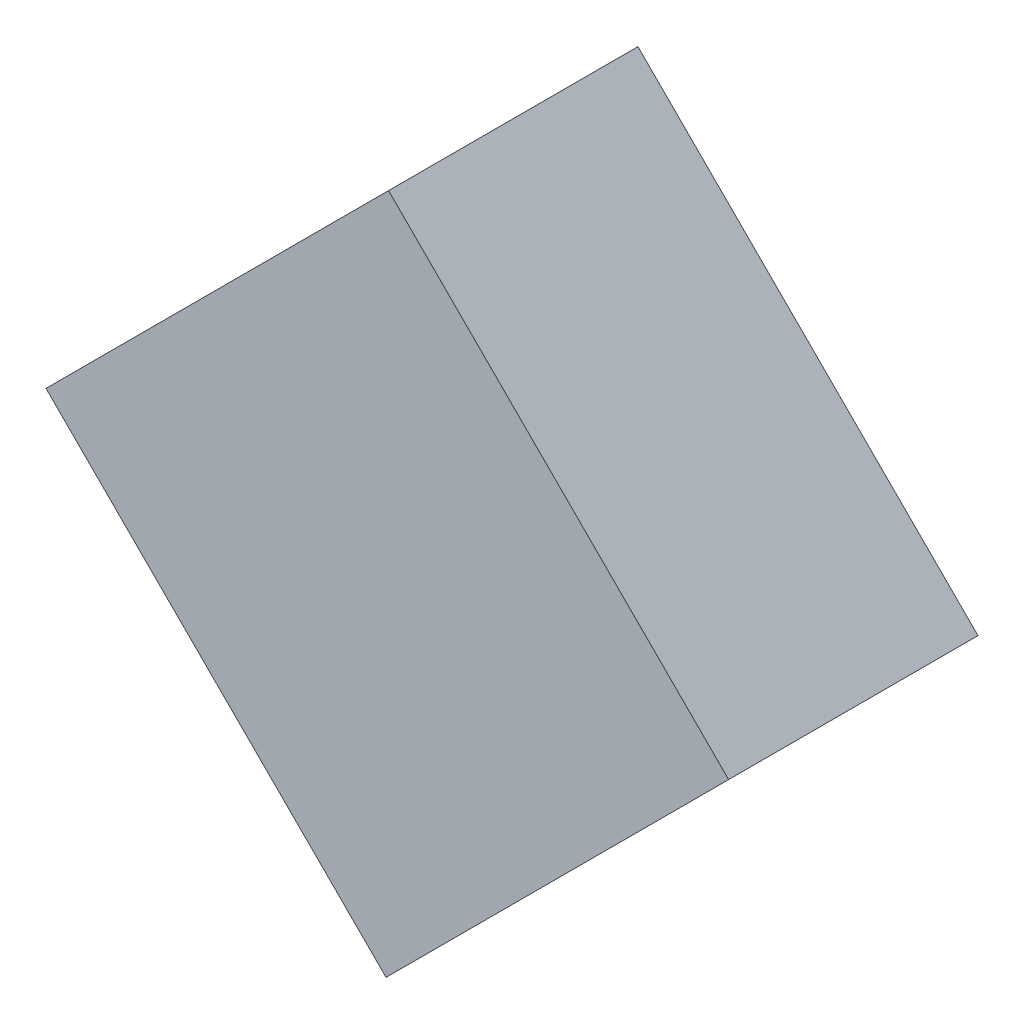
ISO-10303-21;
HEADER;
FILE_DESCRIPTION(('STEP AP214'),'2;1');
FILE_NAME('part.step','',(''),(''),'','','');
FILE_SCHEMA(('AUTOMOTIVE_DESIGN { 1 0 10303 214 1 1 1 1 }'));
ENDSEC;
DATA;
#1=APPLICATION_CONTEXT('core data for automotive mechanical design processes');
#2=APPLICATION_PROTOCOL_DEFINITION('international standard','automotive_design',2000,#1);
#3=PRODUCT_CONTEXT('',#1,'mechanical');
#4=PRODUCT('Part','Part','',(#3));
#5=PRODUCT_RELATED_PRODUCT_CATEGORY('part','',(#4));
#6=PRODUCT_DEFINITION_FORMATION('','',#4);
#7=PRODUCT_DEFINITION_CONTEXT('part definition',#1,'design');
#8=PRODUCT_DEFINITION('design','',#6,#7);
#9=PRODUCT_DEFINITION_SHAPE('','',#8);
#10=(LENGTH_UNIT() NAMED_UNIT(*) SI_UNIT(.MILLI.,.METRE.));
#11=(NAMED_UNIT(*) PLANE_ANGLE_UNIT() SI_UNIT($,.RADIAN.));
#12=(NAMED_UNIT(*) SI_UNIT($,.STERADIAN.) SOLID_ANGLE_UNIT());
#13=UNCERTAINTY_MEASURE_WITH_UNIT(LENGTH_MEASURE(1.E-05),#10,'distance_accuracy_value','');
#14=(GEOMETRIC_REPRESENTATION_CONTEXT(3) GLOBAL_UNCERTAINTY_ASSIGNED_CONTEXT((#13)) GLOBAL_UNIT_ASSIGNED_CONTEXT((#10,
#11,#12)) REPRESENTATION_CONTEXT('',''));
#15=CARTESIAN_POINT('',(0.,0.,0.));
#16=DIRECTION('',(0.,0.,1.));
#17=DIRECTION('',(1.,0.,0.));
#18=AXIS2_PLACEMENT_3D('',#15,#16,#17);
#19=CARTESIAN_POINT('',(0.003538219999996,0.95813118,0.));
#20=DIRECTION('',(0.707106781186548,0.707106781186548,0.));
#21=DIRECTION('',(0.707106781186548,-0.707106781186548,0.));
#22=AXIS2_PLACEMENT_3D('',#19,#20,#21);
#23=PLANE('',#22);
#24=DIRECTION('',(0.,0.,1.));
#25=VECTOR('',#24,1.);
#26=CARTESIAN_POINT('',(0.003538219999996,0.95813118,0.));
#27=LINE('',#26,#25);
#28=CARTESIAN_POINT('',(0.003538219999996,0.95813118,0.));
#29=VERTEX_POINT('',#28);
#30=CARTESIAN_POINT('',(0.003538219999996,0.95813118,0.70000114));
#31=VERTEX_POINT('',#30);
#32=EDGE_CURVE('E11',#29,#31,#27,.T.);
#33=ORIENTED_EDGE('',*,*,#32,.T.);
#34=DIRECTION('',(0.707106781186548,-0.707106781186548,0.));
#35=VECTOR('',#34,1.);
#36=CARTESIAN_POINT('',(0.003538219999996,0.95813118,0.70000114));
#37=LINE('',#36,#35);
#38=CARTESIAN_POINT('',(0.95813118,0.003538219999996,0.70000114));
#39=VERTEX_POINT('',#38);
#40=EDGE_CURVE('E23',#31,#39,#37,.T.);
#41=ORIENTED_EDGE('',*,*,#40,.T.);
#42=DIRECTION('',(0.,0.,1.));
#43=VECTOR('',#42,1.);
#44=CARTESIAN_POINT('',(0.95813118,0.003538219999996,0.));
#45=LINE('',#44,#43);
#46=CARTESIAN_POINT('',(0.95813118,0.003538219999996,0.));
#47=VERTEX_POINT('',#46);
#48=EDGE_CURVE('E84',#47,#39,#45,.T.);
#49=ORIENTED_EDGE('',*,*,#48,.F.);
#50=DIRECTION('',(0.707106781186548,-0.707106781186548,0.));
#51=VECTOR('',#50,1.);
#52=CARTESIAN_POINT('',(0.003538219999996,0.95813118,0.));
#53=LINE('',#52,#51);
#54=EDGE_CURVE('E82',#29,#47,#53,.T.);
#55=ORIENTED_EDGE('',*,*,#54,.F.);
#56=EDGE_LOOP('',(#33,#41,#49,#55));
#57=FACE_BOUND('',#56,.T.);
#58=ADVANCED_FACE('F16',(#57),#23,.T.);
#59=CARTESIAN_POINT('',(0.95813118,0.003538219999996,0.));
#60=DIRECTION('',(0.707106781186548,-0.707106781186548,0.));
#61=DIRECTION('',(-0.707106781186548,-0.707106781186548,0.));
#62=AXIS2_PLACEMENT_3D('',#59,#60,#61);
#63=PLANE('',#62);
#64=ORIENTED_EDGE('',*,*,#48,.T.);
#65=DIRECTION('',(-0.707106781186548,-0.707106781186548,0.));
#66=VECTOR('',#65,1.);
#67=CARTESIAN_POINT('',(0.95813118,0.003538219999996,0.70000114));
#68=LINE('',#67,#66);
#69=CARTESIAN_POINT('',(-0.003535679999999,-0.95812864,0.70000114));
#70=VERTEX_POINT('',#69);
#71=EDGE_CURVE('E80',#39,#70,#68,.T.);
#72=ORIENTED_EDGE('',*,*,#71,.T.);
#73=DIRECTION('',(0.,0.,1.));
#74=VECTOR('',#73,1.);
#75=CARTESIAN_POINT('',(-0.003535679999999,-0.95812864,0.));
#76=LINE('',#75,#74);
#77=CARTESIAN_POINT('',(-0.003535679999999,-0.95812864,0.));
#78=VERTEX_POINT('',#77);
#79=EDGE_CURVE('E78',#78,#70,#76,.T.);
#80=ORIENTED_EDGE('',*,*,#79,.F.);
#81=DIRECTION('',(-0.707106781186548,-0.707106781186548,0.));
#82=VECTOR('',#81,1.);
#83=CARTESIAN_POINT('',(0.95813118,0.003538219999996,0.));
#84=LINE('',#83,#82);
#85=EDGE_CURVE('E69',#47,#78,#84,.T.);
#86=ORIENTED_EDGE('',*,*,#85,.F.);
#87=EDGE_LOOP('',(#64,#72,#80,#86));
#88=FACE_BOUND('',#87,.T.);
#89=ADVANCED_FACE('F89',(#88),#63,.T.);
#90=CARTESIAN_POINT('',(-0.003535679999999,-0.95812864,0.));
#91=DIRECTION('',(-0.707106781186548,-0.707106781186548,0.));
#92=DIRECTION('',(-0.707106781186548,0.707106781186548,0.));
#93=AXIS2_PLACEMENT_3D('',#90,#91,#92);
#94=PLANE('',#93);
#95=ORIENTED_EDGE('',*,*,#79,.T.);
#96=DIRECTION('',(-0.707106781186548,0.707106781186548,0.));
#97=VECTOR('',#96,1.);
#98=CARTESIAN_POINT('',(-0.003535679999999,-0.95812864,0.70000114));
#99=LINE('',#98,#97);
#100=CARTESIAN_POINT('',(-0.95812864,-0.003535680000013,0.70000114));
#101=VERTEX_POINT('',#100);
#102=EDGE_CURVE('E59',#70,#101,#99,.T.);
#103=ORIENTED_EDGE('',*,*,#102,.T.);
#104=DIRECTION('',(0.,0.,1.));
#105=VECTOR('',#104,1.);
#106=CARTESIAN_POINT('',(-0.95812864,-0.003535680000013,0.));
#107=LINE('',#106,#105);
#108=CARTESIAN_POINT('',(-0.95812864,-0.003535680000013,0.));
#109=VERTEX_POINT('',#108);
#110=EDGE_CURVE('E53',#109,#101,#107,.T.);
#111=ORIENTED_EDGE('',*,*,#110,.F.);
#112=DIRECTION('',(-0.707106781186548,0.707106781186548,0.));
#113=VECTOR('',#112,1.);
#114=CARTESIAN_POINT('',(-0.003535679999999,-0.95812864,0.));
#115=LINE('',#114,#113);
#116=EDGE_CURVE('E57',#78,#109,#115,.T.);
#117=ORIENTED_EDGE('',*,*,#116,.F.);
#118=EDGE_LOOP('',(#95,#103,#111,#117));
#119=FACE_BOUND('',#118,.T.);
#120=ADVANCED_FACE('F56',(#119),#94,.T.);
#121=CARTESIAN_POINT('',(-0.95812864,-0.003535680000013,0.));
#122=DIRECTION('',(-0.707106781186548,0.707106781186548,0.));
#123=DIRECTION('',(0.707106781186548,0.707106781186548,0.));
#124=AXIS2_PLACEMENT_3D('',#121,#122,#123);
#125=PLANE('',#124);
#126=ORIENTED_EDGE('',*,*,#110,.T.);
#127=DIRECTION('',(0.707106781186548,0.707106781186548,0.));
#128=VECTOR('',#127,1.);
#129=CARTESIAN_POINT('',(-0.95812864,-0.003535680000013,0.70000114));
#130=LINE('',#129,#128);
#131=EDGE_CURVE('E70',#101,#31,#130,.T.);
#132=ORIENTED_EDGE('',*,*,#131,.T.);
#133=ORIENTED_EDGE('',*,*,#32,.F.);
#134=DIRECTION('',(0.707106781186548,0.707106781186548,0.));
#135=VECTOR('',#134,1.);
#136=CARTESIAN_POINT('',(-0.95812864,-0.003535680000013,0.));
#137=LINE('',#136,#135);
#138=EDGE_CURVE('E67',#109,#29,#137,.T.);
#139=ORIENTED_EDGE('',*,*,#138,.F.);
#140=EDGE_LOOP('',(#126,#132,#133,#139));
#141=FACE_BOUND('',#140,.T.);
#142=ADVANCED_FACE('F72',(#141),#125,.T.);
#143=CARTESIAN_POINT('',(0.003538219999996,0.95813118,0.));
#144=DIRECTION('',(0.,0.,1.));
#145=DIRECTION('',(1.,0.,0.));
#146=AXIS2_PLACEMENT_3D('',#143,#144,#145);
#147=PLANE('',#146);
#148=ORIENTED_EDGE('',*,*,#54,.T.);
#149=ORIENTED_EDGE('',*,*,#85,.T.);
#150=ORIENTED_EDGE('',*,*,#116,.T.);
#151=ORIENTED_EDGE('',*,*,#138,.T.);
#152=EDGE_LOOP('',(#148,#149,#150,#151));
#153=FACE_BOUND('',#152,.T.);
#154=ADVANCED_FACE('F66',(#153),#147,.F.);
#155=CARTESIAN_POINT('',(0.003538219999996,0.95813118,0.70000114));
#156=DIRECTION('',(0.,0.,1.));
#157=DIRECTION('',(1.,0.,0.));
#158=AXIS2_PLACEMENT_3D('',#155,#156,#157);
#159=PLANE('',#158);
#160=ORIENTED_EDGE('',*,*,#131,.F.);
#161=ORIENTED_EDGE('',*,*,#102,.F.);
#162=ORIENTED_EDGE('',*,*,#71,.F.);
#163=ORIENTED_EDGE('',*,*,#40,.F.);
#164=EDGE_LOOP('',(#160,#161,#162,#163));
#165=FACE_BOUND('',#164,.T.);
#166=ADVANCED_FACE('F90',(#165),#159,.T.);
#167=CLOSED_SHELL('',(#58,#89,#120,#142,#154,#166));
#168=MANIFOLD_SOLID_BREP('B1',#167);
#169=ADVANCED_BREP_SHAPE_REPRESENTATION('',(#18,#168),#14);
#170=SHAPE_DEFINITION_REPRESENTATION(#9,#169);
ENDSEC;
END-ISO-10303-21;
